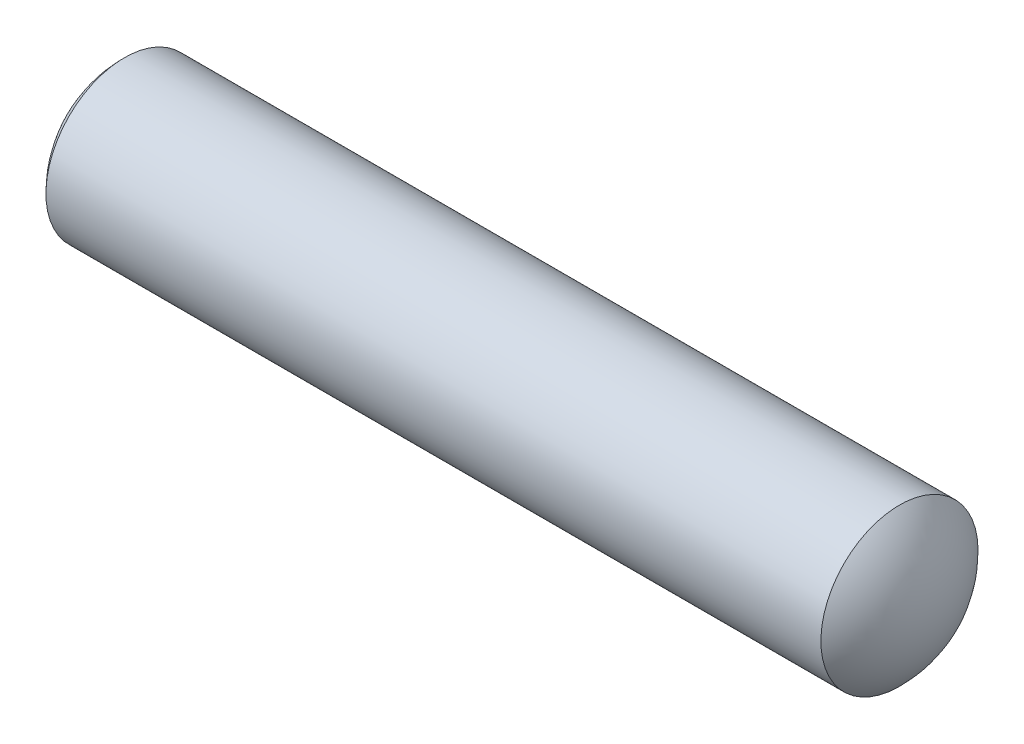
ISO-10303-21;
HEADER;
FILE_DESCRIPTION(('STEP AP214'),'2;1');
FILE_NAME('part.step','',(''),(''),'','','');
FILE_SCHEMA(('AUTOMOTIVE_DESIGN { 1 0 10303 214 1 1 1 1 }'));
ENDSEC;
DATA;
#1=APPLICATION_CONTEXT('core data for automotive mechanical design processes');
#2=APPLICATION_PROTOCOL_DEFINITION('international standard','automotive_design',2000,#1);
#3=PRODUCT_CONTEXT('',#1,'mechanical');
#4=PRODUCT('Part','Part','',(#3));
#5=PRODUCT_RELATED_PRODUCT_CATEGORY('part','',(#4));
#6=PRODUCT_DEFINITION_FORMATION('','',#4);
#7=PRODUCT_DEFINITION_CONTEXT('part definition',#1,'design');
#8=PRODUCT_DEFINITION('design','',#6,#7);
#9=PRODUCT_DEFINITION_SHAPE('','',#8);
#10=(LENGTH_UNIT() NAMED_UNIT(*) SI_UNIT(.MILLI.,.METRE.));
#11=(NAMED_UNIT(*) PLANE_ANGLE_UNIT() SI_UNIT($,.RADIAN.));
#12=(NAMED_UNIT(*) SI_UNIT($,.STERADIAN.) SOLID_ANGLE_UNIT());
#13=UNCERTAINTY_MEASURE_WITH_UNIT(LENGTH_MEASURE(1.E-05),#10,'distance_accuracy_value','');
#14=(GEOMETRIC_REPRESENTATION_CONTEXT(3) GLOBAL_UNCERTAINTY_ASSIGNED_CONTEXT((#13)) GLOBAL_UNIT_ASSIGNED_CONTEXT((#10,
#11,#12)) REPRESENTATION_CONTEXT('',''));
#15=CARTESIAN_POINT('',(0.,0.,0.));
#16=DIRECTION('',(0.,0.,1.));
#17=DIRECTION('',(1.,0.,0.));
#18=AXIS2_PLACEMENT_3D('',#15,#16,#17);
#19=CARTESIAN_POINT('',(15.1875,-3.03308499069939,21.0955694800874));
#20=DIRECTION('',(0.,-0.989821441880933,-0.142314838273284));
#21=DIRECTION('',(1.,0.,0.));
#22=AXIS2_PLACEMENT_3D('',#19,#20,#21);
#23=SPHERICAL_SURFACE('',#22,1.8375);
#24=CARTESIAN_POINT('',(15.1875,-3.03308499069939,21.0955694800874));
#25=DIRECTION('',(-1.,0.,0.));
#26=DIRECTION('',(0.,0.142314838273285,-0.989821441880933));
#27=AXIS2_PLACEMENT_3D('',#24,#25,#26);
#28=SPHERICAL_SURFACE('',#27,1.8375);
#29=CARTESIAN_POINT('',(16.4734821149612,-3.03308499069939,21.0955694800874));
#30=DIRECTION('',(-1.,0.,0.));
#31=DIRECTION('',(0.,0.142314838273285,-0.989821441880933));
#32=AXIS2_PLACEMENT_3D('',#29,#30,#31);
#33=CIRCLE('',#32,1.3125);
#34=CARTESIAN_POINT('',(16.4734821149612,-2.8462967654657,19.7964288376187));
#35=VERTEX_POINT('',#34);
#36=EDGE_CURVE('E11',#35,#35,#33,.T.);
#37=ORIENTED_EDGE('',*,*,#36,.F.);
#38=EDGE_LOOP('',(#37));
#39=FACE_BOUND('',#38,.T.);
#40=ADVANCED_FACE('F17',(#39),#28,.T.);
#41=CARTESIAN_POINT('',(10.,-3.03308499069939,21.0955694800874));
#42=DIRECTION('',(-1.,0.,0.));
#43=DIRECTION('',(0.,0.142314838273285,-0.989821441880933));
#44=AXIS2_PLACEMENT_3D('',#41,#42,#43);
#45=CYLINDRICAL_SURFACE('',#44,1.3125);
#46=CARTESIAN_POINT('',(3.52651788503884,-3.03308499069939,21.0955694800874));
#47=DIRECTION('',(-1.,0.,0.));
#48=DIRECTION('',(0.,0.142314838273285,-0.989821441880933));
#49=AXIS2_PLACEMENT_3D('',#46,#47,#48);
#50=CIRCLE('',#49,1.3125);
#51=CARTESIAN_POINT('',(3.52651788503884,-2.8462967654657,19.7964288376187));
#52=VERTEX_POINT('',#51);
#53=EDGE_CURVE('E26',#52,#52,#50,.T.);
#54=ORIENTED_EDGE('',*,*,#53,.F.);
#55=EDGE_LOOP('',(#54));
#56=FACE_BOUND('',#55,.T.);
#57=ORIENTED_EDGE('',*,*,#36,.T.);
#58=EDGE_LOOP('',(#57));
#59=FACE_BOUND('',#58,.T.);
#60=ADVANCED_FACE('F47',(#56,#59),#45,.T.);
#61=CARTESIAN_POINT('',(4.8125,-3.03308499069939,21.0955694800874));
#62=DIRECTION('',(0.,-0.989821441880933,-0.142314838273284));
#63=DIRECTION('',(-1.,0.,0.));
#64=AXIS2_PLACEMENT_3D('',#61,#62,#63);
#65=SPHERICAL_SURFACE('',#64,1.8375);
#66=CARTESIAN_POINT('',(4.8125,-3.03308499069939,21.0955694800874));
#67=DIRECTION('',(-1.,0.,0.));
#68=DIRECTION('',(0.,0.142314838273285,-0.989821441880933));
#69=AXIS2_PLACEMENT_3D('',#66,#67,#68);
#70=SPHERICAL_SURFACE('',#69,1.8375);
#71=ORIENTED_EDGE('',*,*,#53,.T.);
#72=EDGE_LOOP('',(#71));
#73=FACE_BOUND('',#72,.T.);
#74=ADVANCED_FACE('F39',(#73),#70,.T.);
#75=CLOSED_SHELL('',(#40,#60,#74));
#76=MANIFOLD_SOLID_BREP('B1',#75);
#77=ADVANCED_BREP_SHAPE_REPRESENTATION('',(#18,#76),#14);
#78=SHAPE_DEFINITION_REPRESENTATION(#9,#77);
ENDSEC;
END-ISO-10303-21;
